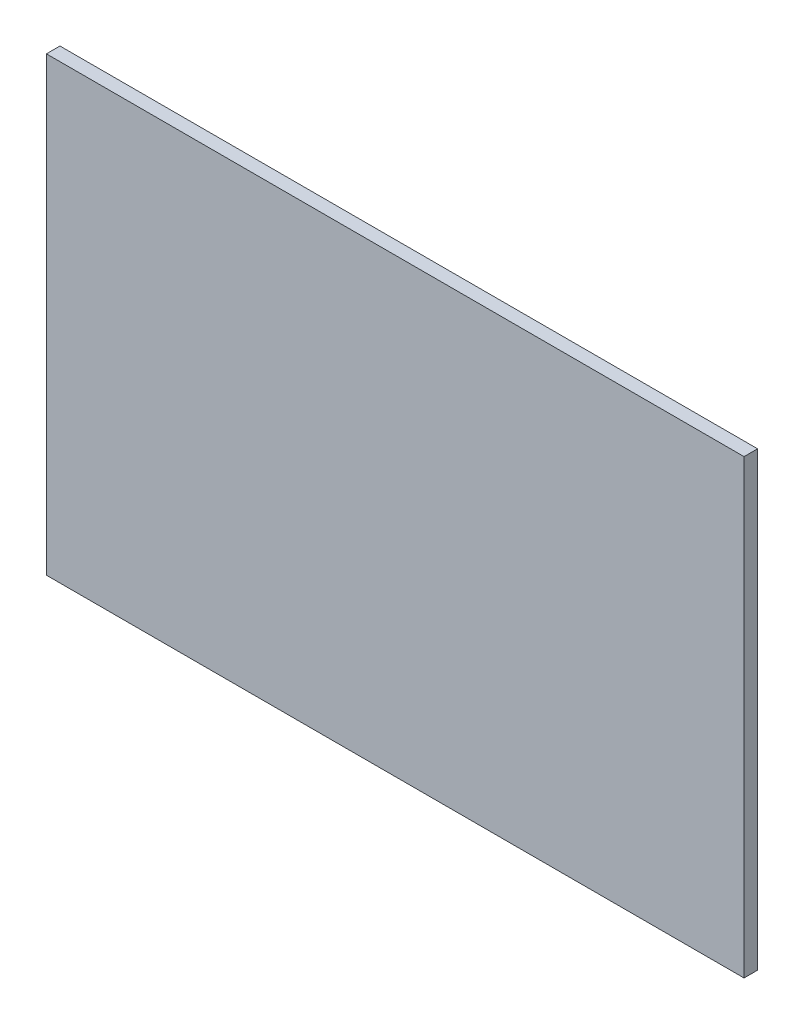
ISO-10303-21;
HEADER;
FILE_DESCRIPTION(('STEP AP214'),'2;1');
FILE_NAME('part.step','',(''),(''),'','','');
FILE_SCHEMA(('AUTOMOTIVE_DESIGN { 1 0 10303 214 1 1 1 1 }'));
ENDSEC;
DATA;
#1=APPLICATION_CONTEXT('core data for automotive mechanical design processes');
#2=APPLICATION_PROTOCOL_DEFINITION('international standard','automotive_design',2000,#1);
#3=PRODUCT_CONTEXT('',#1,'mechanical');
#4=PRODUCT('Part','Part','',(#3));
#5=PRODUCT_RELATED_PRODUCT_CATEGORY('part','',(#4));
#6=PRODUCT_DEFINITION_FORMATION('','',#4);
#7=PRODUCT_DEFINITION_CONTEXT('part definition',#1,'design');
#8=PRODUCT_DEFINITION('design','',#6,#7);
#9=PRODUCT_DEFINITION_SHAPE('','',#8);
#10=(LENGTH_UNIT() NAMED_UNIT(*) SI_UNIT(.MILLI.,.METRE.));
#11=(NAMED_UNIT(*) PLANE_ANGLE_UNIT() SI_UNIT($,.RADIAN.));
#12=(NAMED_UNIT(*) SI_UNIT($,.STERADIAN.) SOLID_ANGLE_UNIT());
#13=UNCERTAINTY_MEASURE_WITH_UNIT(LENGTH_MEASURE(1.E-05),#10,'distance_accuracy_value','');
#14=(GEOMETRIC_REPRESENTATION_CONTEXT(3) GLOBAL_UNCERTAINTY_ASSIGNED_CONTEXT((#13)) GLOBAL_UNIT_ASSIGNED_CONTEXT((#10,
#11,#12)) REPRESENTATION_CONTEXT('',''));
#15=CARTESIAN_POINT('',(0.,0.,0.));
#16=DIRECTION('',(0.,0.,1.));
#17=DIRECTION('',(1.,0.,0.));
#18=AXIS2_PLACEMENT_3D('',#15,#16,#17);
#19=CARTESIAN_POINT('',(-151.567496011281,208.304362229887,3.));
#20=DIRECTION('',(-1.,0.,0.));
#21=DIRECTION('',(0.,-1.,0.));
#22=AXIS2_PLACEMENT_3D('',#19,#20,#21);
#23=PLANE('',#22);
#24=DIRECTION('',(0.,1.,0.));
#25=VECTOR('',#24,1.);
#26=CARTESIAN_POINT('',(-151.567496011281,208.304362229887,0.));
#27=LINE('',#26,#25);
#28=CARTESIAN_POINT('',(-151.567496011281,108.304362229887,0.));
#29=VERTEX_POINT('',#28);
#30=CARTESIAN_POINT('',(-151.567496011281,208.304362229887,0.));
#31=VERTEX_POINT('',#30);
#32=EDGE_CURVE('E97',#29,#31,#27,.T.);
#33=ORIENTED_EDGE('',*,*,#32,.T.);
#34=DIRECTION('',(0.,0.,-1.));
#35=VECTOR('',#34,1.);
#36=CARTESIAN_POINT('',(-151.567496011281,208.304362229887,3.));
#37=LINE('',#36,#35);
#38=CARTESIAN_POINT('',(-151.567496011281,208.304362229887,3.));
#39=VERTEX_POINT('',#38);
#40=EDGE_CURVE('E11',#39,#31,#37,.T.);
#41=ORIENTED_EDGE('',*,*,#40,.F.);
#42=DIRECTION('',(0.,1.,0.));
#43=VECTOR('',#42,1.);
#44=CARTESIAN_POINT('',(-151.567496011281,208.304362229887,3.));
#45=LINE('',#44,#43);
#46=CARTESIAN_POINT('',(-151.567496011281,108.304362229887,3.));
#47=VERTEX_POINT('',#46);
#48=EDGE_CURVE('E85',#47,#39,#45,.T.);
#49=ORIENTED_EDGE('',*,*,#48,.F.);
#50=DIRECTION('',(0.,0.,-1.));
#51=VECTOR('',#50,1.);
#52=CARTESIAN_POINT('',(-151.567496011281,108.304362229887,3.));
#53=LINE('',#52,#51);
#54=EDGE_CURVE('E93',#47,#29,#53,.T.);
#55=ORIENTED_EDGE('',*,*,#54,.T.);
#56=EDGE_LOOP('',(#33,#41,#49,#55));
#57=FACE_BOUND('',#56,.T.);
#58=ADVANCED_FACE('F34',(#57),#23,.F.);
#59=CARTESIAN_POINT('',(-151.567496011281,208.304362229887,3.));
#60=DIRECTION('',(0.,-1.,0.));
#61=DIRECTION('',(0.,0.,-1.));
#62=AXIS2_PLACEMENT_3D('',#59,#60,#61);
#63=PLANE('',#62);
#64=DIRECTION('',(-1.,0.,0.));
#65=VECTOR('',#64,1.);
#66=CARTESIAN_POINT('',(-151.567496011281,208.304362229887,0.));
#67=LINE('',#66,#65);
#68=CARTESIAN_POINT('',(-306.067496011281,208.304362229887,0.));
#69=VERTEX_POINT('',#68);
#70=EDGE_CURVE('E89',#31,#69,#67,.T.);
#71=ORIENTED_EDGE('',*,*,#70,.T.);
#72=DIRECTION('',(0.,0.,-1.));
#73=VECTOR('',#72,1.);
#74=CARTESIAN_POINT('',(-306.067496011281,208.304362229887,3.));
#75=LINE('',#74,#73);
#76=CARTESIAN_POINT('',(-306.067496011281,208.304362229887,3.));
#77=VERTEX_POINT('',#76);
#78=EDGE_CURVE('E42',#77,#69,#75,.T.);
#79=ORIENTED_EDGE('',*,*,#78,.F.);
#80=DIRECTION('',(-1.,0.,0.));
#81=VECTOR('',#80,1.);
#82=CARTESIAN_POINT('',(-151.567496011281,208.304362229887,3.));
#83=LINE('',#82,#81);
#84=EDGE_CURVE('E80',#39,#77,#83,.T.);
#85=ORIENTED_EDGE('',*,*,#84,.F.);
#86=ORIENTED_EDGE('',*,*,#40,.T.);
#87=EDGE_LOOP('',(#71,#79,#85,#86));
#88=FACE_BOUND('',#87,.T.);
#89=ADVANCED_FACE('F88',(#88),#63,.F.);
#90=CARTESIAN_POINT('',(-306.067496011281,208.304362229887,3.));
#91=DIRECTION('',(1.,0.,0.));
#92=DIRECTION('',(0.,0.,-1.));
#93=AXIS2_PLACEMENT_3D('',#90,#91,#92);
#94=PLANE('',#93);
#95=DIRECTION('',(0.,-1.,0.));
#96=VECTOR('',#95,1.);
#97=CARTESIAN_POINT('',(-306.067496011281,208.304362229887,0.));
#98=LINE('',#97,#96);
#99=CARTESIAN_POINT('',(-306.067496011281,108.304362229887,0.));
#100=VERTEX_POINT('',#99);
#101=EDGE_CURVE('E67',#69,#100,#98,.T.);
#102=ORIENTED_EDGE('',*,*,#101,.T.);
#103=DIRECTION('',(0.,0.,-1.));
#104=VECTOR('',#103,1.);
#105=CARTESIAN_POINT('',(-306.067496011281,108.304362229887,3.));
#106=LINE('',#105,#104);
#107=CARTESIAN_POINT('',(-306.067496011281,108.304362229887,3.));
#108=VERTEX_POINT('',#107);
#109=EDGE_CURVE('E90',#108,#100,#106,.T.);
#110=ORIENTED_EDGE('',*,*,#109,.F.);
#111=DIRECTION('',(0.,-1.,0.));
#112=VECTOR('',#111,1.);
#113=CARTESIAN_POINT('',(-306.067496011281,208.304362229887,3.));
#114=LINE('',#113,#112);
#115=EDGE_CURVE('E83',#77,#108,#114,.T.);
#116=ORIENTED_EDGE('',*,*,#115,.F.);
#117=ORIENTED_EDGE('',*,*,#78,.T.);
#118=EDGE_LOOP('',(#102,#110,#116,#117));
#119=FACE_BOUND('',#118,.T.);
#120=ADVANCED_FACE('F91',(#119),#94,.F.);
#121=CARTESIAN_POINT('',(-151.567496011281,108.304362229887,3.));
#122=DIRECTION('',(0.,1.,0.));
#123=DIRECTION('',(-1.,0.,0.));
#124=AXIS2_PLACEMENT_3D('',#121,#122,#123);
#125=PLANE('',#124);
#126=DIRECTION('',(1.,0.,0.));
#127=VECTOR('',#126,1.);
#128=CARTESIAN_POINT('',(-151.567496011281,108.304362229887,0.));
#129=LINE('',#128,#127);
#130=EDGE_CURVE('E73',#100,#29,#129,.T.);
#131=ORIENTED_EDGE('',*,*,#130,.T.);
#132=ORIENTED_EDGE('',*,*,#54,.F.);
#133=DIRECTION('',(1.,0.,0.));
#134=VECTOR('',#133,1.);
#135=CARTESIAN_POINT('',(-151.567496011281,108.304362229887,3.));
#136=LINE('',#135,#134);
#137=EDGE_CURVE('E50',#108,#47,#136,.T.);
#138=ORIENTED_EDGE('',*,*,#137,.F.);
#139=ORIENTED_EDGE('',*,*,#109,.T.);
#140=EDGE_LOOP('',(#131,#132,#138,#139));
#141=FACE_BOUND('',#140,.T.);
#142=ADVANCED_FACE('F104',(#141),#125,.F.);
#143=CARTESIAN_POINT('',(-151.567496011281,108.304362229887,3.));
#144=DIRECTION('',(0.,0.,-1.));
#145=DIRECTION('',(-1.,0.,0.));
#146=AXIS2_PLACEMENT_3D('',#143,#144,#145);
#147=PLANE('',#146);
#148=ORIENTED_EDGE('',*,*,#48,.T.);
#149=ORIENTED_EDGE('',*,*,#84,.T.);
#150=ORIENTED_EDGE('',*,*,#115,.T.);
#151=ORIENTED_EDGE('',*,*,#137,.T.);
#152=EDGE_LOOP('',(#148,#149,#150,#151));
#153=FACE_BOUND('',#152,.T.);
#154=ADVANCED_FACE('F81',(#153),#147,.F.);
#155=CARTESIAN_POINT('',(-151.567496011281,108.304362229887,0.));
#156=DIRECTION('',(0.,0.,-1.));
#157=DIRECTION('',(-1.,0.,0.));
#158=AXIS2_PLACEMENT_3D('',#155,#156,#157);
#159=PLANE('',#158);
#160=ORIENTED_EDGE('',*,*,#32,.F.);
#161=ORIENTED_EDGE('',*,*,#130,.F.);
#162=ORIENTED_EDGE('',*,*,#101,.F.);
#163=ORIENTED_EDGE('',*,*,#70,.F.);
#164=EDGE_LOOP('',(#160,#161,#162,#163));
#165=FACE_BOUND('',#164,.T.);
#166=ADVANCED_FACE('F107',(#165),#159,.T.);
#167=CLOSED_SHELL('',(#58,#89,#120,#142,#154,#166));
#168=MANIFOLD_SOLID_BREP('B2',#167);
#169=ADVANCED_BREP_SHAPE_REPRESENTATION('',(#18,#168),#14);
#170=SHAPE_DEFINITION_REPRESENTATION(#9,#169);
ENDSEC;
END-ISO-10303-21;
